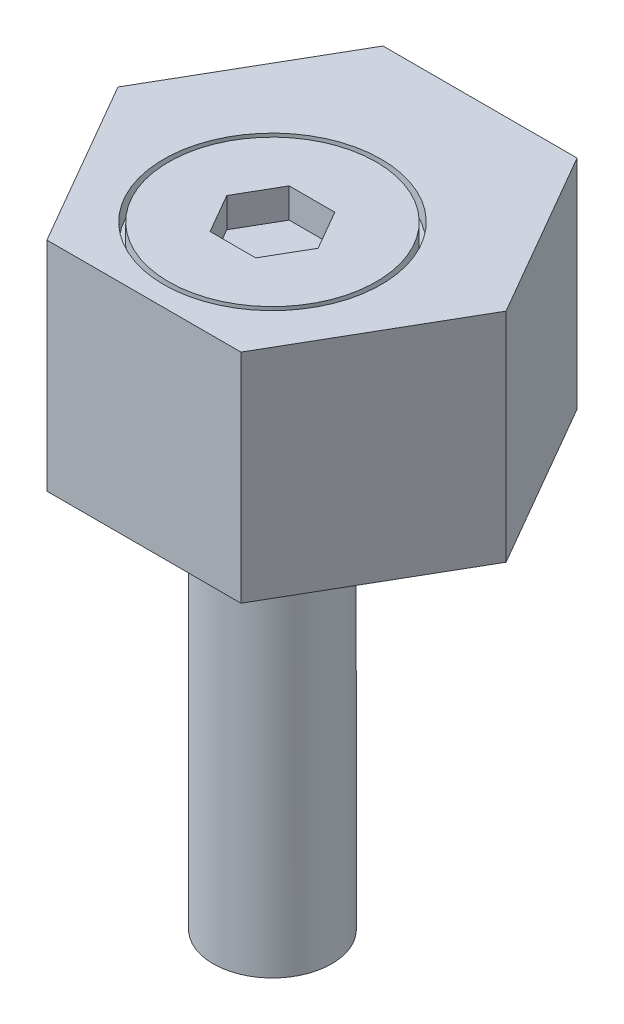
ISO-10303-21;
HEADER;
FILE_DESCRIPTION(('STEP AP214'),'2;1');
FILE_NAME('part.step','',(''),(''),'','','');
FILE_SCHEMA(('AUTOMOTIVE_DESIGN { 1 0 10303 214 1 1 1 1 }'));
ENDSEC;
DATA;
#1=APPLICATION_CONTEXT('core data for automotive mechanical design processes');
#2=APPLICATION_PROTOCOL_DEFINITION('international standard','automotive_design',2000,#1);
#3=PRODUCT_CONTEXT('',#1,'mechanical');
#4=PRODUCT('Part','Part','',(#3));
#5=PRODUCT_RELATED_PRODUCT_CATEGORY('part','',(#4));
#6=PRODUCT_DEFINITION_FORMATION('','',#4);
#7=PRODUCT_DEFINITION_CONTEXT('part definition',#1,'design');
#8=PRODUCT_DEFINITION('design','',#6,#7);
#9=PRODUCT_DEFINITION_SHAPE('','',#8);
#10=(LENGTH_UNIT() NAMED_UNIT(*) SI_UNIT(.MILLI.,.METRE.));
#11=(NAMED_UNIT(*) PLANE_ANGLE_UNIT() SI_UNIT($,.RADIAN.));
#12=(NAMED_UNIT(*) SI_UNIT($,.STERADIAN.) SOLID_ANGLE_UNIT());
#13=UNCERTAINTY_MEASURE_WITH_UNIT(LENGTH_MEASURE(1.E-05),#10,'distance_accuracy_value','');
#14=(GEOMETRIC_REPRESENTATION_CONTEXT(3) GLOBAL_UNCERTAINTY_ASSIGNED_CONTEXT((#13)) GLOBAL_UNIT_ASSIGNED_CONTEXT((#10,
#11,#12)) REPRESENTATION_CONTEXT('',''));
#15=CARTESIAN_POINT('',(0.,0.,0.));
#16=DIRECTION('',(0.,0.,1.));
#17=DIRECTION('',(1.,0.,0.));
#18=AXIS2_PLACEMENT_3D('',#15,#16,#17);
#19=CARTESIAN_POINT('',(-3.,-12.,-3.));
#20=DIRECTION('',(0.,-1.,0.));
#21=DIRECTION('',(1.,0.,0.));
#22=AXIS2_PLACEMENT_3D('',#19,#20,#21);
#23=PLANE('',#22);
#24=CARTESIAN_POINT('',(0.,-12.,0.));
#25=DIRECTION('',(0.,-1.,0.));
#26=DIRECTION('',(0.,0.,1.));
#27=AXIS2_PLACEMENT_3D('',#24,#25,#26);
#28=CIRCLE('',#27,3.);
#29=CARTESIAN_POINT('',(0.,-12.,3.));
#30=VERTEX_POINT('',#29);
#31=EDGE_CURVE('E124',#30,#30,#28,.T.);
#32=ORIENTED_EDGE('',*,*,#31,.T.);
#33=EDGE_LOOP('',(#32));
#34=FACE_BOUND('',#33,.T.);
#35=ADVANCED_FACE('F16',(#34),#23,.T.);
#36=CARTESIAN_POINT('',(-4.9074772881118,8.,-10.5));
#37=DIRECTION('',(-0.866025403784439,0.,-0.499999999999999));
#38=DIRECTION('',(-0.499999999999999,0.,0.866025403784439));
#39=AXIS2_PLACEMENT_3D('',#36,#37,#38);
#40=PLANE('',#39);
#41=DIRECTION('',(0.499999999999999,0.,-0.866025403784439));
#42=VECTOR('',#41,1.);
#43=CARTESIAN_POINT('',(-9.81495457622361,19.,-2.));
#44=LINE('',#43,#42);
#45=CARTESIAN_POINT('',(-4.9074772881118,19.,-10.5));
#46=VERTEX_POINT('',#45);
#47=CARTESIAN_POINT('',(-9.81495457622361,19.,-2.));
#48=VERTEX_POINT('',#47);
#49=EDGE_CURVE('E105',#46,#48,#44,.F.);
#50=ORIENTED_EDGE('',*,*,#49,.F.);
#51=DIRECTION('',(0.,-1.,0.));
#52=VECTOR('',#51,1.);
#53=CARTESIAN_POINT('',(-4.9074772881118,19.,-10.5));
#54=LINE('',#53,#52);
#55=CARTESIAN_POINT('',(-4.9074772881118,8.,-10.5));
#56=VERTEX_POINT('',#55);
#57=EDGE_CURVE('E121',#56,#46,#54,.F.);
#58=ORIENTED_EDGE('',*,*,#57,.F.);
#59=DIRECTION('',(-0.499999999999999,0.,0.866025403784439));
#60=VECTOR('',#59,1.);
#61=CARTESIAN_POINT('',(-4.9074772881118,8.,-10.5));
#62=LINE('',#61,#60);
#63=CARTESIAN_POINT('',(-9.81495457622361,8.,-2.));
#64=VERTEX_POINT('',#63);
#65=EDGE_CURVE('E128',#56,#64,#62,.T.);
#66=ORIENTED_EDGE('',*,*,#65,.T.);
#67=DIRECTION('',(0.,1.,0.));
#68=VECTOR('',#67,1.);
#69=CARTESIAN_POINT('',(-9.81495457622361,8.,-2.));
#70=LINE('',#69,#68);
#71=EDGE_CURVE('E123',#64,#48,#70,.T.);
#72=ORIENTED_EDGE('',*,*,#71,.T.);
#73=EDGE_LOOP('',(#50,#58,#66,#72));
#74=FACE_BOUND('',#73,.T.);
#75=ADVANCED_FACE('F119',(#74),#40,.T.);
#76=CARTESIAN_POINT('',(-9.8149545762236,8.,-2.));
#77=DIRECTION('',(-0.866025403784439,0.,0.499999999999999));
#78=DIRECTION('',(0.499999999999999,0.,0.866025403784439));
#79=AXIS2_PLACEMENT_3D('',#76,#77,#78);
#80=PLANE('',#79);
#81=DIRECTION('',(-0.499999999999999,0.,-0.866025403784439));
#82=VECTOR('',#81,1.);
#83=CARTESIAN_POINT('',(-4.90747728811179,19.,6.5));
#84=LINE('',#83,#82);
#85=CARTESIAN_POINT('',(-4.90747728811179,19.,6.5));
#86=VERTEX_POINT('',#85);
#87=EDGE_CURVE('E139',#48,#86,#84,.F.);
#88=ORIENTED_EDGE('',*,*,#87,.F.);
#89=ORIENTED_EDGE('',*,*,#71,.F.);
#90=DIRECTION('',(0.499999999999999,0.,0.866025403784439));
#91=VECTOR('',#90,1.);
#92=CARTESIAN_POINT('',(-9.8149545762236,8.,-2.));
#93=LINE('',#92,#91);
#94=CARTESIAN_POINT('',(-4.90747728811179,8.,6.5));
#95=VERTEX_POINT('',#94);
#96=EDGE_CURVE('E143',#64,#95,#93,.T.);
#97=ORIENTED_EDGE('',*,*,#96,.T.);
#98=DIRECTION('',(0.,1.,0.));
#99=VECTOR('',#98,1.);
#100=CARTESIAN_POINT('',(-4.90747728811179,8.,6.5));
#101=LINE('',#100,#99);
#102=EDGE_CURVE('E148',#95,#86,#101,.T.);
#103=ORIENTED_EDGE('',*,*,#102,.T.);
#104=EDGE_LOOP('',(#88,#89,#97,#103));
#105=FACE_BOUND('',#104,.T.);
#106=ADVANCED_FACE('F333',(#105),#80,.T.);
#107=CARTESIAN_POINT('',(-4.9074772881118,8.,6.5));
#108=DIRECTION('',(0.,0.,1.));
#109=DIRECTION('',(1.,0.,0.));
#110=AXIS2_PLACEMENT_3D('',#107,#108,#109);
#111=PLANE('',#110);
#112=DIRECTION('',(-1.,0.,0.));
#113=VECTOR('',#112,1.);
#114=CARTESIAN_POINT('',(4.9074772881118,19.,6.5));
#115=LINE('',#114,#113);
#116=CARTESIAN_POINT('',(4.9074772881118,19.,6.5));
#117=VERTEX_POINT('',#116);
#118=EDGE_CURVE('E153',#86,#117,#115,.F.);
#119=ORIENTED_EDGE('',*,*,#118,.F.);
#120=ORIENTED_EDGE('',*,*,#102,.F.);
#121=DIRECTION('',(1.,0.,0.));
#122=VECTOR('',#121,1.);
#123=CARTESIAN_POINT('',(-4.9074772881118,8.,6.5));
#124=LINE('',#123,#122);
#125=CARTESIAN_POINT('',(4.9074772881118,8.,6.5));
#126=VERTEX_POINT('',#125);
#127=EDGE_CURVE('E157',#95,#126,#124,.T.);
#128=ORIENTED_EDGE('',*,*,#127,.T.);
#129=DIRECTION('',(0.,1.,0.));
#130=VECTOR('',#129,1.);
#131=CARTESIAN_POINT('',(4.9074772881118,8.,6.5));
#132=LINE('',#131,#130);
#133=EDGE_CURVE('E162',#126,#117,#132,.T.);
#134=ORIENTED_EDGE('',*,*,#133,.T.);
#135=EDGE_LOOP('',(#119,#120,#128,#134));
#136=FACE_BOUND('',#135,.T.);
#137=ADVANCED_FACE('F339',(#136),#111,.T.);
#138=CARTESIAN_POINT('',(4.9074772881118,8.,6.5));
#139=DIRECTION('',(0.866025403784439,0.,0.499999999999999));
#140=DIRECTION('',(0.499999999999999,0.,-0.866025403784439));
#141=AXIS2_PLACEMENT_3D('',#138,#139,#140);
#142=PLANE('',#141);
#143=DIRECTION('',(-0.499999999999999,0.,0.866025403784439));
#144=VECTOR('',#143,1.);
#145=CARTESIAN_POINT('',(9.81495457622361,19.,-2.));
#146=LINE('',#145,#144);
#147=CARTESIAN_POINT('',(9.81495457622361,19.,-2.));
#148=VERTEX_POINT('',#147);
#149=EDGE_CURVE('E167',#117,#148,#146,.F.);
#150=ORIENTED_EDGE('',*,*,#149,.F.);
#151=ORIENTED_EDGE('',*,*,#133,.F.);
#152=DIRECTION('',(0.499999999999999,0.,-0.866025403784439));
#153=VECTOR('',#152,1.);
#154=CARTESIAN_POINT('',(4.9074772881118,8.,6.5));
#155=LINE('',#154,#153);
#156=CARTESIAN_POINT('',(9.81495457622361,8.,-2.));
#157=VERTEX_POINT('',#156);
#158=EDGE_CURVE('E171',#126,#157,#155,.T.);
#159=ORIENTED_EDGE('',*,*,#158,.T.);
#160=DIRECTION('',(0.,1.,0.));
#161=VECTOR('',#160,1.);
#162=CARTESIAN_POINT('',(9.81495457622361,8.,-2.));
#163=LINE('',#162,#161);
#164=EDGE_CURVE('E176',#157,#148,#163,.T.);
#165=ORIENTED_EDGE('',*,*,#164,.T.);
#166=EDGE_LOOP('',(#150,#151,#159,#165));
#167=FACE_BOUND('',#166,.T.);
#168=ADVANCED_FACE('F343',(#167),#142,.T.);
#169=CARTESIAN_POINT('',(9.8149545762236,8.,-2.));
#170=DIRECTION('',(0.866025403784439,0.,-0.499999999999999));
#171=DIRECTION('',(-0.499999999999999,0.,-0.866025403784439));
#172=AXIS2_PLACEMENT_3D('',#169,#170,#171);
#173=PLANE('',#172);
#174=DIRECTION('',(0.499999999999999,0.,0.866025403784439));
#175=VECTOR('',#174,1.);
#176=CARTESIAN_POINT('',(4.90747728811179,19.,-10.5));
#177=LINE('',#176,#175);
#178=CARTESIAN_POINT('',(4.90747728811179,19.,-10.5));
#179=VERTEX_POINT('',#178);
#180=EDGE_CURVE('E108',#148,#179,#177,.F.);
#181=ORIENTED_EDGE('',*,*,#180,.F.);
#182=ORIENTED_EDGE('',*,*,#164,.F.);
#183=DIRECTION('',(-0.499999999999999,0.,-0.866025403784439));
#184=VECTOR('',#183,1.);
#185=CARTESIAN_POINT('',(9.8149545762236,8.,-2.));
#186=LINE('',#185,#184);
#187=CARTESIAN_POINT('',(4.90747728811179,8.,-10.5));
#188=VERTEX_POINT('',#187);
#189=EDGE_CURVE('E184',#157,#188,#186,.T.);
#190=ORIENTED_EDGE('',*,*,#189,.T.);
#191=DIRECTION('',(0.,1.,0.));
#192=VECTOR('',#191,1.);
#193=CARTESIAN_POINT('',(4.90747728811179,8.,-10.5));
#194=LINE('',#193,#192);
#195=EDGE_CURVE('E114',#188,#179,#194,.T.);
#196=ORIENTED_EDGE('',*,*,#195,.T.);
#197=EDGE_LOOP('',(#181,#182,#190,#196));
#198=FACE_BOUND('',#197,.T.);
#199=ADVANCED_FACE('F347',(#198),#173,.T.);
#200=CARTESIAN_POINT('',(4.9074772881118,8.,-10.5));
#201=DIRECTION('',(0.,0.,-1.));
#202=DIRECTION('',(-1.,0.,0.));
#203=AXIS2_PLACEMENT_3D('',#200,#201,#202);
#204=PLANE('',#203);
#205=DIRECTION('',(1.,0.,0.));
#206=VECTOR('',#205,1.);
#207=CARTESIAN_POINT('',(-4.9074772881118,19.,-10.5));
#208=LINE('',#207,#206);
#209=EDGE_CURVE('E101',#179,#46,#208,.F.);
#210=ORIENTED_EDGE('',*,*,#209,.F.);
#211=ORIENTED_EDGE('',*,*,#195,.F.);
#212=DIRECTION('',(-1.,0.,0.));
#213=VECTOR('',#212,1.);
#214=CARTESIAN_POINT('',(4.9074772881118,8.,-10.5));
#215=LINE('',#214,#213);
#216=EDGE_CURVE('E113',#188,#56,#215,.T.);
#217=ORIENTED_EDGE('',*,*,#216,.T.);
#218=ORIENTED_EDGE('',*,*,#57,.T.);
#219=EDGE_LOOP('',(#210,#211,#217,#218));
#220=FACE_BOUND('',#219,.T.);
#221=ADVANCED_FACE('F127',(#220),#204,.T.);
#222=CARTESIAN_POINT('',(-9.81495457622361,8.,-10.5));
#223=DIRECTION('',(0.,-1.,0.));
#224=DIRECTION('',(1.,0.,0.));
#225=AXIS2_PLACEMENT_3D('',#222,#223,#224);
#226=PLANE('',#225);
#227=ORIENTED_EDGE('',*,*,#65,.F.);
#228=ORIENTED_EDGE('',*,*,#216,.F.);
#229=ORIENTED_EDGE('',*,*,#189,.F.);
#230=ORIENTED_EDGE('',*,*,#158,.F.);
#231=ORIENTED_EDGE('',*,*,#127,.F.);
#232=ORIENTED_EDGE('',*,*,#96,.F.);
#233=EDGE_LOOP('',(#227,#228,#229,#230,#231,#232));
#234=FACE_BOUND('',#233,.T.);
#235=CARTESIAN_POINT('',(0.,8.,0.));
#236=DIRECTION('',(0.,1.,0.));
#237=DIRECTION('',(0.,0.,-1.));
#238=AXIS2_PLACEMENT_3D('',#235,#236,#237);
#239=CIRCLE('',#238,3.);
#240=CARTESIAN_POINT('',(0.,8.,-3.));
#241=VERTEX_POINT('',#240);
#242=EDGE_CURVE('E197',#241,#241,#239,.T.);
#243=ORIENTED_EDGE('',*,*,#242,.T.);
#244=EDGE_LOOP('',(#243));
#245=FACE_BOUND('',#244,.T.);
#246=ADVANCED_FACE('F354',(#234,#245),#226,.T.);
#247=CARTESIAN_POINT('',(-9.81495457622361,19.,-10.5));
#248=DIRECTION('',(0.,1.,0.));
#249=DIRECTION('',(0.,0.,1.));
#250=AXIS2_PLACEMENT_3D('',#247,#248,#249);
#251=PLANE('',#250);
#252=ORIENTED_EDGE('',*,*,#49,.T.);
#253=ORIENTED_EDGE('',*,*,#87,.T.);
#254=ORIENTED_EDGE('',*,*,#118,.T.);
#255=ORIENTED_EDGE('',*,*,#149,.T.);
#256=ORIENTED_EDGE('',*,*,#180,.T.);
#257=ORIENTED_EDGE('',*,*,#209,.T.);
#258=EDGE_LOOP('',(#252,#253,#254,#255,#256,#257));
#259=FACE_BOUND('',#258,.T.);
#260=CARTESIAN_POINT('',(0.,19.,0.));
#261=DIRECTION('',(0.,-1.,0.));
#262=DIRECTION('',(0.,0.,1.));
#263=AXIS2_PLACEMENT_3D('',#260,#261,#262);
#264=CIRCLE('',#263,5.5);
#265=CARTESIAN_POINT('',(0.,19.,5.5));
#266=VERTEX_POINT('',#265);
#267=EDGE_CURVE('E202',#266,#266,#264,.T.);
#268=ORIENTED_EDGE('',*,*,#267,.T.);
#269=EDGE_LOOP('',(#268));
#270=FACE_BOUND('',#269,.T.);
#271=ADVANCED_FACE('F103',(#259,#270),#251,.T.);
#272=CARTESIAN_POINT('',(-5.5,18.,5.5));
#273=DIRECTION('',(0.,1.,0.));
#274=DIRECTION('',(1.,0.,0.));
#275=AXIS2_PLACEMENT_3D('',#272,#273,#274);
#276=PLANE('',#275);
#277=CARTESIAN_POINT('',(0.,18.,0.));
#278=DIRECTION('',(0.,1.,0.));
#279=DIRECTION('',(0.,0.,-1.));
#280=AXIS2_PLACEMENT_3D('',#277,#278,#279);
#281=CIRCLE('',#280,5.5);
#282=CARTESIAN_POINT('',(0.,18.,-5.5));
#283=VERTEX_POINT('',#282);
#284=EDGE_CURVE('E205',#283,#283,#281,.F.);
#285=ORIENTED_EDGE('',*,*,#284,.F.);
#286=EDGE_LOOP('',(#285));
#287=FACE_BOUND('',#286,.T.);
#288=CARTESIAN_POINT('',(0.,18.,0.));
#289=DIRECTION('',(0.,-1.,0.));
#290=DIRECTION('',(0.,0.,1.));
#291=AXIS2_PLACEMENT_3D('',#288,#289,#290);
#292=CIRCLE('',#291,5.25);
#293=CARTESIAN_POINT('',(0.,18.,5.25));
#294=VERTEX_POINT('',#293);
#295=EDGE_CURVE('E208',#294,#294,#292,.T.);
#296=ORIENTED_EDGE('',*,*,#295,.T.);
#297=EDGE_LOOP('',(#296));
#298=FACE_BOUND('',#297,.T.);
#299=ADVANCED_FACE('F360',(#287,#298),#276,.T.);
#300=CARTESIAN_POINT('',(-5.32082048514982,19.,-5.25));
#301=DIRECTION('',(0.,1.,0.));
#302=DIRECTION('',(0.,0.,1.));
#303=AXIS2_PLACEMENT_3D('',#300,#301,#302);
#304=PLANE('',#303);
#305=CARTESIAN_POINT('',(0.,19.,0.));
#306=DIRECTION('',(0.,1.,0.));
#307=DIRECTION('',(0.,0.,-1.));
#308=AXIS2_PLACEMENT_3D('',#305,#306,#307);
#309=CIRCLE('',#308,5.25);
#310=CARTESIAN_POINT('',(0.,19.,-5.25));
#311=VERTEX_POINT('',#310);
#312=EDGE_CURVE('E211',#311,#311,#309,.F.);
#313=ORIENTED_EDGE('',*,*,#312,.F.);
#314=EDGE_LOOP('',(#313));
#315=FACE_BOUND('',#314,.T.);
#316=DIRECTION('',(0.499999999999983,0.,-0.866025403784448));
#317=VECTOR('',#316,1.);
#318=CARTESIAN_POINT('',(-2.3094010767585,19.,0.));
#319=LINE('',#318,#317);
#320=CARTESIAN_POINT('',(-1.1547005383793,19.,-2.));
#321=VERTEX_POINT('',#320);
#322=CARTESIAN_POINT('',(-2.3094010767585,19.,0.));
#323=VERTEX_POINT('',#322);
#324=EDGE_CURVE('E214',#321,#323,#319,.F.);
#325=ORIENTED_EDGE('',*,*,#324,.F.);
#326=DIRECTION('',(1.,0.,0.));
#327=VECTOR('',#326,1.);
#328=CARTESIAN_POINT('',(-1.1547005383793,19.,-2.));
#329=LINE('',#328,#327);
#330=CARTESIAN_POINT('',(1.1547005383793,19.,-2.));
#331=VERTEX_POINT('',#330);
#332=EDGE_CURVE('E217',#331,#321,#329,.F.);
#333=ORIENTED_EDGE('',*,*,#332,.F.);
#334=DIRECTION('',(0.499999999999983,0.,0.866025403784448));
#335=VECTOR('',#334,1.);
#336=CARTESIAN_POINT('',(1.1547005383793,19.,-2.));
#337=LINE('',#336,#335);
#338=CARTESIAN_POINT('',(2.3094010767585,19.,0.));
#339=VERTEX_POINT('',#338);
#340=EDGE_CURVE('E221',#339,#331,#337,.F.);
#341=ORIENTED_EDGE('',*,*,#340,.F.);
#342=DIRECTION('',(-0.499999999999984,0.,0.866025403784448));
#343=VECTOR('',#342,1.);
#344=CARTESIAN_POINT('',(2.3094010767585,19.,0.));
#345=LINE('',#344,#343);
#346=CARTESIAN_POINT('',(1.1547005383793,19.,2.));
#347=VERTEX_POINT('',#346);
#348=EDGE_CURVE('E226',#347,#339,#345,.F.);
#349=ORIENTED_EDGE('',*,*,#348,.F.);
#350=DIRECTION('',(-1.,0.,0.));
#351=VECTOR('',#350,1.);
#352=CARTESIAN_POINT('',(1.1547005383793,19.,2.));
#353=LINE('',#352,#351);
#354=CARTESIAN_POINT('',(-1.1547005383793,19.,2.));
#355=VERTEX_POINT('',#354);
#356=EDGE_CURVE('E231',#355,#347,#353,.F.);
#357=ORIENTED_EDGE('',*,*,#356,.F.);
#358=DIRECTION('',(-0.499999999999983,0.,-0.866025403784448));
#359=VECTOR('',#358,1.);
#360=CARTESIAN_POINT('',(-1.1547005383793,19.,2.));
#361=LINE('',#360,#359);
#362=EDGE_CURVE('E236',#323,#355,#361,.F.);
#363=ORIENTED_EDGE('',*,*,#362,.F.);
#364=EDGE_LOOP('',(#325,#333,#341,#349,#357,#363));
#365=FACE_BOUND('',#364,.T.);
#366=ADVANCED_FACE('F294',(#315,#365),#304,.T.);
#367=CARTESIAN_POINT('',(-1.1547005383793,17.5,-2.));
#368=DIRECTION('',(0.866025403784449,0.,0.499999999999983));
#369=DIRECTION('',(0.,1.,0.));
#370=AXIS2_PLACEMENT_3D('',#367,#368,#369);
#371=PLANE('',#370);
#372=ORIENTED_EDGE('',*,*,#324,.T.);
#373=DIRECTION('',(0.,-1.,0.));
#374=VECTOR('',#373,1.);
#375=CARTESIAN_POINT('',(-2.3094010767585,19.,0.));
#376=LINE('',#375,#374);
#377=CARTESIAN_POINT('',(-2.3094010767585,17.5,0.));
#378=VERTEX_POINT('',#377);
#379=EDGE_CURVE('E241',#378,#323,#376,.F.);
#380=ORIENTED_EDGE('',*,*,#379,.F.);
#381=DIRECTION('',(0.499999999999983,0.,-0.866025403784449));
#382=VECTOR('',#381,1.);
#383=CARTESIAN_POINT('',(-2.3094010767585,17.5,0.));
#384=LINE('',#383,#382);
#385=CARTESIAN_POINT('',(-1.1547005383793,17.5,-2.));
#386=VERTEX_POINT('',#385);
#387=EDGE_CURVE('E245',#386,#378,#384,.F.);
#388=ORIENTED_EDGE('',*,*,#387,.F.);
#389=DIRECTION('',(0.,1.,0.));
#390=VECTOR('',#389,1.);
#391=CARTESIAN_POINT('',(-1.1547005383793,17.5,-2.));
#392=LINE('',#391,#390);
#393=EDGE_CURVE('E249',#386,#321,#392,.T.);
#394=ORIENTED_EDGE('',*,*,#393,.T.);
#395=EDGE_LOOP('',(#372,#380,#388,#394));
#396=FACE_BOUND('',#395,.T.);
#397=ADVANCED_FACE('F312',(#396),#371,.T.);
#398=CARTESIAN_POINT('',(-2.3094010767585,17.5,0.));
#399=DIRECTION('',(0.866025403784449,0.,-0.499999999999983));
#400=DIRECTION('',(0.,1.,0.));
#401=AXIS2_PLACEMENT_3D('',#398,#399,#400);
#402=PLANE('',#401);
#403=ORIENTED_EDGE('',*,*,#362,.T.);
#404=DIRECTION('',(0.,-1.,0.));
#405=VECTOR('',#404,1.);
#406=CARTESIAN_POINT('',(-1.1547005383793,19.,2.));
#407=LINE('',#406,#405);
#408=CARTESIAN_POINT('',(-1.1547005383793,17.5,2.));
#409=VERTEX_POINT('',#408);
#410=EDGE_CURVE('E254',#409,#355,#407,.F.);
#411=ORIENTED_EDGE('',*,*,#410,.F.);
#412=DIRECTION('',(-0.499999999999983,0.,-0.866025403784449));
#413=VECTOR('',#412,1.);
#414=CARTESIAN_POINT('',(-1.1547005383793,17.5,2.));
#415=LINE('',#414,#413);
#416=EDGE_CURVE('E258',#378,#409,#415,.F.);
#417=ORIENTED_EDGE('',*,*,#416,.F.);
#418=ORIENTED_EDGE('',*,*,#379,.T.);
#419=EDGE_LOOP('',(#403,#411,#417,#418));
#420=FACE_BOUND('',#419,.T.);
#421=ADVANCED_FACE('F309',(#420),#402,.T.);
#422=CARTESIAN_POINT('',(-1.1547005383793,17.5,2.));
#423=DIRECTION('',(0.,0.,-1.));
#424=DIRECTION('',(0.,1.,0.));
#425=AXIS2_PLACEMENT_3D('',#422,#423,#424);
#426=PLANE('',#425);
#427=ORIENTED_EDGE('',*,*,#356,.T.);
#428=DIRECTION('',(0.,-1.,0.));
#429=VECTOR('',#428,1.);
#430=CARTESIAN_POINT('',(1.1547005383793,19.,2.));
#431=LINE('',#430,#429);
#432=CARTESIAN_POINT('',(1.1547005383793,17.5,2.));
#433=VERTEX_POINT('',#432);
#434=EDGE_CURVE('E262',#433,#347,#431,.F.);
#435=ORIENTED_EDGE('',*,*,#434,.F.);
#436=DIRECTION('',(-1.,0.,0.));
#437=VECTOR('',#436,1.);
#438=CARTESIAN_POINT('',(1.1547005383793,17.5,2.));
#439=LINE('',#438,#437);
#440=EDGE_CURVE('E266',#409,#433,#439,.F.);
#441=ORIENTED_EDGE('',*,*,#440,.F.);
#442=ORIENTED_EDGE('',*,*,#410,.T.);
#443=EDGE_LOOP('',(#427,#435,#441,#442));
#444=FACE_BOUND('',#443,.T.);
#445=ADVANCED_FACE('F304',(#444),#426,.T.);
#446=CARTESIAN_POINT('',(1.1547005383793,17.5,2.));
#447=DIRECTION('',(-0.866025403784449,0.,-0.499999999999983));
#448=DIRECTION('',(0.,1.,0.));
#449=AXIS2_PLACEMENT_3D('',#446,#447,#448);
#450=PLANE('',#449);
#451=ORIENTED_EDGE('',*,*,#348,.T.);
#452=DIRECTION('',(0.,-1.,0.));
#453=VECTOR('',#452,1.);
#454=CARTESIAN_POINT('',(2.3094010767585,19.,0.));
#455=LINE('',#454,#453);
#456=CARTESIAN_POINT('',(2.3094010767585,17.5,0.));
#457=VERTEX_POINT('',#456);
#458=EDGE_CURVE('E270',#457,#339,#455,.F.);
#459=ORIENTED_EDGE('',*,*,#458,.F.);
#460=DIRECTION('',(-0.499999999999983,0.,0.866025403784449));
#461=VECTOR('',#460,1.);
#462=CARTESIAN_POINT('',(2.3094010767585,17.5,0.));
#463=LINE('',#462,#461);
#464=EDGE_CURVE('E35',#433,#457,#463,.F.);
#465=ORIENTED_EDGE('',*,*,#464,.F.);
#466=ORIENTED_EDGE('',*,*,#434,.T.);
#467=EDGE_LOOP('',(#451,#459,#465,#466));
#468=FACE_BOUND('',#467,.T.);
#469=ADVANCED_FACE('F300',(#468),#450,.T.);
#470=CARTESIAN_POINT('',(2.3094010767585,17.5,0.));
#471=DIRECTION('',(-0.866025403784449,0.,0.499999999999983));
#472=DIRECTION('',(0.,1.,0.));
#473=AXIS2_PLACEMENT_3D('',#470,#471,#472);
#474=PLANE('',#473);
#475=ORIENTED_EDGE('',*,*,#340,.T.);
#476=DIRECTION('',(0.,-1.,0.));
#477=VECTOR('',#476,1.);
#478=CARTESIAN_POINT('',(1.1547005383793,19.,-2.));
#479=LINE('',#478,#477);
#480=CARTESIAN_POINT('',(1.1547005383793,17.5,-2.));
#481=VERTEX_POINT('',#480);
#482=EDGE_CURVE('E277',#481,#331,#479,.F.);
#483=ORIENTED_EDGE('',*,*,#482,.F.);
#484=DIRECTION('',(0.499999999999983,0.,0.866025403784449));
#485=VECTOR('',#484,1.);
#486=CARTESIAN_POINT('',(1.1547005383793,17.5,-2.));
#487=LINE('',#486,#485);
#488=EDGE_CURVE('E25',#457,#481,#487,.F.);
#489=ORIENTED_EDGE('',*,*,#488,.F.);
#490=ORIENTED_EDGE('',*,*,#458,.T.);
#491=EDGE_LOOP('',(#475,#483,#489,#490));
#492=FACE_BOUND('',#491,.T.);
#493=ADVANCED_FACE('F297',(#492),#474,.T.);
#494=CARTESIAN_POINT('',(1.1547005383793,17.5,-2.));
#495=DIRECTION('',(0.,0.,1.));
#496=DIRECTION('',(0.,1.,0.));
#497=AXIS2_PLACEMENT_3D('',#494,#495,#496);
#498=PLANE('',#497);
#499=ORIENTED_EDGE('',*,*,#332,.T.);
#500=ORIENTED_EDGE('',*,*,#393,.F.);
#501=DIRECTION('',(1.,0.,0.));
#502=VECTOR('',#501,1.);
#503=CARTESIAN_POINT('',(-1.1547005383793,17.5,-2.));
#504=LINE('',#503,#502);
#505=EDGE_CURVE('E11',#481,#386,#504,.F.);
#506=ORIENTED_EDGE('',*,*,#505,.F.);
#507=ORIENTED_EDGE('',*,*,#482,.T.);
#508=EDGE_LOOP('',(#499,#500,#506,#507));
#509=FACE_BOUND('',#508,.T.);
#510=ADVANCED_FACE('F288',(#509),#498,.T.);
#511=CARTESIAN_POINT('',(-2.3094010767585,17.5,-2.));
#512=DIRECTION('',(0.,1.,0.));
#513=DIRECTION('',(0.,0.,1.));
#514=AXIS2_PLACEMENT_3D('',#511,#512,#513);
#515=PLANE('',#514);
#516=ORIENTED_EDGE('',*,*,#387,.T.);
#517=ORIENTED_EDGE('',*,*,#416,.T.);
#518=ORIENTED_EDGE('',*,*,#440,.T.);
#519=ORIENTED_EDGE('',*,*,#464,.T.);
#520=ORIENTED_EDGE('',*,*,#488,.T.);
#521=ORIENTED_EDGE('',*,*,#505,.T.);
#522=EDGE_LOOP('',(#516,#517,#518,#519,#520,#521));
#523=FACE_BOUND('',#522,.T.);
#524=ADVANCED_FACE('F314',(#523),#515,.T.);
#525=CARTESIAN_POINT('',(0.,-12.,0.));
#526=DIRECTION('',(0.,-1.,0.));
#527=DIRECTION('',(1.42053895879963E-07,0.,0.99999999999999));
#528=AXIS2_PLACEMENT_3D('',#525,#526,#527);
#529=CYLINDRICAL_SURFACE('',#528,3.);
#530=ORIENTED_EDGE('',*,*,#31,.F.);
#531=EDGE_LOOP('',(#530));
#532=FACE_BOUND('',#531,.T.);
#533=ORIENTED_EDGE('',*,*,#242,.F.);
#534=EDGE_LOOP('',(#533));
#535=FACE_BOUND('',#534,.T.);
#536=ADVANCED_FACE('F316',(#532,#535),#529,.T.);
#537=CARTESIAN_POINT('',(0.,18.,0.));
#538=DIRECTION('',(0.,-1.,0.));
#539=DIRECTION('',(1.41721894786679E-07,0.,0.99999999999999));
#540=AXIS2_PLACEMENT_3D('',#537,#538,#539);
#541=CYLINDRICAL_SURFACE('',#540,5.25);
#542=ORIENTED_EDGE('',*,*,#295,.F.);
#543=EDGE_LOOP('',(#542));
#544=FACE_BOUND('',#543,.T.);
#545=ORIENTED_EDGE('',*,*,#312,.T.);
#546=EDGE_LOOP('',(#545));
#547=FACE_BOUND('',#546,.T.);
#548=ADVANCED_FACE('F323',(#544,#547),#541,.T.);
#549=CARTESIAN_POINT('',(0.,18.,0.));
#550=DIRECTION('',(0.,-1.,0.));
#551=DIRECTION('',(0.,0.,1.));
#552=AXIS2_PLACEMENT_3D('',#549,#550,#551);
#553=CYLINDRICAL_SURFACE('',#552,5.5);
#554=ORIENTED_EDGE('',*,*,#267,.F.);
#555=EDGE_LOOP('',(#554));
#556=FACE_BOUND('',#555,.T.);
#557=ORIENTED_EDGE('',*,*,#284,.T.);
#558=EDGE_LOOP('',(#557));
#559=FACE_BOUND('',#558,.T.);
#560=ADVANCED_FACE('F18',(#556,#559),#553,.F.);
#561=CLOSED_SHELL('',(#35,#75,#106,#137,#168,#199,#221,#246,#271,#299,#366,#397,#421,#445,#469,
#493,#510,#524,#536,#548,#560));
#562=MANIFOLD_SOLID_BREP('B1',#561);
#563=ADVANCED_BREP_SHAPE_REPRESENTATION('',(#18,#562),#14);
#564=SHAPE_DEFINITION_REPRESENTATION(#9,#563);
ENDSEC;
END-ISO-10303-21;
